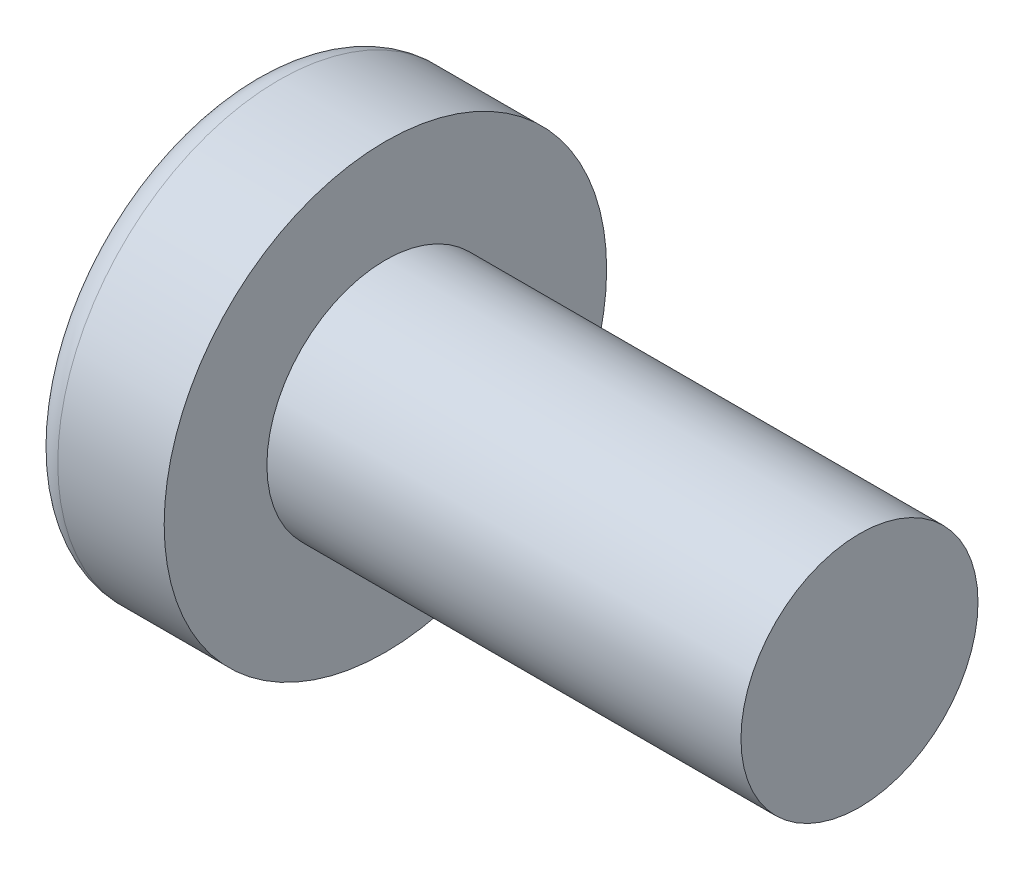
ISO-10303-21;
HEADER;
FILE_DESCRIPTION(('STEP AP214'),'2;1');
FILE_NAME('part.step','',(''),(''),'','','');
FILE_SCHEMA(('AUTOMOTIVE_DESIGN { 1 0 10303 214 1 1 1 1 }'));
ENDSEC;
DATA;
#1=APPLICATION_CONTEXT('core data for automotive mechanical design processes');
#2=APPLICATION_PROTOCOL_DEFINITION('international standard','automotive_design',2000,#1);
#3=PRODUCT_CONTEXT('',#1,'mechanical');
#4=PRODUCT('Part','Part','',(#3));
#5=PRODUCT_RELATED_PRODUCT_CATEGORY('part','',(#4));
#6=PRODUCT_DEFINITION_FORMATION('','',#4);
#7=PRODUCT_DEFINITION_CONTEXT('part definition',#1,'design');
#8=PRODUCT_DEFINITION('design','',#6,#7);
#9=PRODUCT_DEFINITION_SHAPE('','',#8);
#10=(LENGTH_UNIT() NAMED_UNIT(*) SI_UNIT(.MILLI.,.METRE.));
#11=(NAMED_UNIT(*) PLANE_ANGLE_UNIT() SI_UNIT($,.RADIAN.));
#12=(NAMED_UNIT(*) SI_UNIT($,.STERADIAN.) SOLID_ANGLE_UNIT());
#13=UNCERTAINTY_MEASURE_WITH_UNIT(LENGTH_MEASURE(1.E-05),#10,'distance_accuracy_value','');
#14=(GEOMETRIC_REPRESENTATION_CONTEXT(3) GLOBAL_UNCERTAINTY_ASSIGNED_CONTEXT((#13)) GLOBAL_UNIT_ASSIGNED_CONTEXT((#10,
#11,#12)) REPRESENTATION_CONTEXT('',''));
#15=CARTESIAN_POINT('',(0.,0.,0.));
#16=DIRECTION('',(0.,0.,1.));
#17=DIRECTION('',(1.,0.,0.));
#18=AXIS2_PLACEMENT_3D('',#15,#16,#17);
#19=CARTESIAN_POINT('',(5.,0.,0.));
#20=DIRECTION('',(-1.,0.,0.));
#21=DIRECTION('',(0.,1.,0.));
#22=AXIS2_PLACEMENT_3D('',#19,#20,#21);
#23=SPHERICAL_SURFACE('',#22,5.);
#24=CARTESIAN_POINT('',(0.747150706810473,0.,0.));
#25=DIRECTION('',(-1.,0.,0.));
#26=DIRECTION('',(0.,0.,1.));
#27=AXIS2_PLACEMENT_3D('',#24,#25,#26);
#28=CIRCLE('',#27,2.62931034482759);
#29=CARTESIAN_POINT('',(0.747150706810473,0.,2.62931034482759));
#30=VERTEX_POINT('',#29);
#31=EDGE_CURVE('E152',#30,#30,#28,.T.);
#32=ORIENTED_EDGE('',*,*,#31,.T.);
#33=EDGE_LOOP('',(#32));
#34=FACE_BOUND('',#33,.T.);
#35=CARTESIAN_POINT('',(4.98382636322272,-0.153868112043297,0.));
#36=DIRECTION('',(-0.104537710696287,-0.994520923380891,0.));
#37=DIRECTION('',(0.994520923380891,-0.104537710696287,0.));
#38=AXIS2_PLACEMENT_3D('',#35,#36,#37);
#39=CIRCLE('',#38,4.99760572850336);
#40=CARTESIAN_POINT('',(0.188596138461545,0.350175974082163,1.31444652548076));
#41=VERTEX_POINT('',#40);
#42=CARTESIAN_POINT('',(0.0270341343313624,0.367158343834486,0.367158343834487));
#43=VERTEX_POINT('',#42);
#44=EDGE_CURVE('E183',#41,#43,#39,.T.);
#45=ORIENTED_EDGE('',*,*,#44,.F.);
#46=CARTESIAN_POINT('',(3.98403090792016,0.,-1.41352221506761));
#47=DIRECTION('',(0.583636048152575,0.,0.812015371342713));
#48=DIRECTION('',(0.812015371342714,0.,-0.583636048152575));
#49=AXIS2_PLACEMENT_3D('',#46,#47,#48);
#50=CIRCLE('',#49,4.68719124331927);
#51=CARTESIAN_POINT('',(0.188596138461545,-0.350175974082172,1.31444652548076));
#52=VERTEX_POINT('',#51);
#53=EDGE_CURVE('E148',#41,#52,#50,.T.);
#54=ORIENTED_EDGE('',*,*,#53,.T.);
#55=CARTESIAN_POINT('',(4.98382636322272,0.153868112043297,0.));
#56=DIRECTION('',(-0.104537710696287,0.994520923380891,0.));
#57=DIRECTION('',(-0.994520923380891,-0.104537710696287,0.));
#58=AXIS2_PLACEMENT_3D('',#55,#56,#57);
#59=CIRCLE('',#58,4.99760572850336);
#60=CARTESIAN_POINT('',(0.0270341343313616,-0.367158343834489,0.367158343834487));
#61=VERTEX_POINT('',#60);
#62=EDGE_CURVE('E104',#61,#52,#59,.T.);
#63=ORIENTED_EDGE('',*,*,#62,.F.);
#64=CARTESIAN_POINT('',(4.98382636322272,0.,-0.153868112043297));
#65=DIRECTION('',(-0.104537710696287,0.,-0.994520923380891));
#66=DIRECTION('',(-0.994520923380891,0.,0.104537710696287));
#67=AXIS2_PLACEMENT_3D('',#64,#65,#66);
#68=CIRCLE('',#67,4.99760572850336);
#69=CARTESIAN_POINT('',(0.188596138461545,-1.31444652548077,0.350175974082167));
#70=VERTEX_POINT('',#69);
#71=EDGE_CURVE('E129',#70,#61,#68,.T.);
#72=ORIENTED_EDGE('',*,*,#71,.F.);
#73=CARTESIAN_POINT('',(3.98403090792016,1.41352221506761,0.));
#74=DIRECTION('',(0.583636048152575,-0.812015371342713,0.));
#75=DIRECTION('',(0.812015371342714,0.583636048152575,0.));
#76=AXIS2_PLACEMENT_3D('',#73,#74,#75);
#77=CIRCLE('',#76,4.68719124331927);
#78=CARTESIAN_POINT('',(0.188596138461545,-1.31444652548077,-0.350175974082167));
#79=VERTEX_POINT('',#78);
#80=EDGE_CURVE('E137',#70,#79,#77,.T.);
#81=ORIENTED_EDGE('',*,*,#80,.T.);
#82=CARTESIAN_POINT('',(4.98382636322272,0.,0.153868112043297));
#83=DIRECTION('',(-0.104537710696287,0.,0.994520923380891));
#84=DIRECTION('',(0.994520923380891,0.,0.104537710696287));
#85=AXIS2_PLACEMENT_3D('',#82,#83,#84);
#86=CIRCLE('',#85,4.99760572850336);
#87=CARTESIAN_POINT('',(0.0270341343313624,-0.367158343834486,-0.367158343834487));
#88=VERTEX_POINT('',#87);
#89=EDGE_CURVE('E47',#88,#79,#86,.T.);
#90=ORIENTED_EDGE('',*,*,#89,.F.);
#91=CARTESIAN_POINT('',(0.188596138461545,-0.350175974082162,-1.31444652548077));
#92=VERTEX_POINT('',#91);
#93=EDGE_CURVE('E190',#92,#88,#59,.T.);
#94=ORIENTED_EDGE('',*,*,#93,.F.);
#95=CARTESIAN_POINT('',(3.98403090792016,0.,1.41352221506761));
#96=DIRECTION('',(0.583636048152575,0.,-0.812015371342713));
#97=DIRECTION('',(-0.812015371342714,0.,-0.583636048152575));
#98=AXIS2_PLACEMENT_3D('',#95,#96,#97);
#99=CIRCLE('',#98,4.68719124331927);
#100=CARTESIAN_POINT('',(0.188596138461545,0.350175974082172,-1.31444652548076));
#101=VERTEX_POINT('',#100);
#102=EDGE_CURVE('E130',#92,#101,#99,.T.);
#103=ORIENTED_EDGE('',*,*,#102,.T.);
#104=CARTESIAN_POINT('',(0.0270341343313616,0.367158343834489,-0.367158343834487));
#105=VERTEX_POINT('',#104);
#106=EDGE_CURVE('E178',#105,#101,#39,.T.);
#107=ORIENTED_EDGE('',*,*,#106,.F.);
#108=CARTESIAN_POINT('',(0.188596138461545,1.31444652548076,-0.350175974082167));
#109=VERTEX_POINT('',#108);
#110=EDGE_CURVE('E40',#109,#105,#86,.T.);
#111=ORIENTED_EDGE('',*,*,#110,.F.);
#112=CARTESIAN_POINT('',(3.98403090792016,-1.41352221506761,0.));
#113=DIRECTION('',(0.583636048152575,0.812015371342713,0.));
#114=DIRECTION('',(-0.812015371342714,0.583636048152575,0.));
#115=AXIS2_PLACEMENT_3D('',#112,#113,#114);
#116=CIRCLE('',#115,4.68719124331927);
#117=CARTESIAN_POINT('',(0.188596138461545,1.31444652548076,0.350175974082167));
#118=VERTEX_POINT('',#117);
#119=EDGE_CURVE('E11',#109,#118,#116,.T.);
#120=ORIENTED_EDGE('',*,*,#119,.T.);
#121=EDGE_CURVE('E166',#43,#118,#68,.T.);
#122=ORIENTED_EDGE('',*,*,#121,.F.);
#123=EDGE_LOOP('',(#45,#54,#63,#72,#81,#90,#94,#103,#107,#111,#120,#122));
#124=FACE_BOUND('',#123,.T.);
#125=ADVANCED_FACE('F32',(#34,#124),#23,.T.);
#126=CARTESIAN_POINT('',(2.01739130434783,0.,-0.15794466403162));
#127=DIRECTION('',(-0.104537710696287,0.,0.994520923380891));
#128=DIRECTION('',(0.994520923380891,0.,0.104537710696287));
#129=AXIS2_PLACEMENT_3D('',#126,#127,#128);
#130=PLANE('',#129);
#131=ORIENTED_EDGE('',*,*,#110,.T.);
#132=DIRECTION('',(0.989130931836555,-0.103971149085093,0.103971149085092));
#133=VECTOR('',#132,1.);
#134=CARTESIAN_POINT('',(2.03363450411053,0.156237282238383,-0.156237282238382));
#135=LINE('',#134,#133);
#136=CARTESIAN_POINT('',(1.76,0.185000000000001,-0.184999999999999));
#137=VERTEX_POINT('',#136);
#138=EDGE_CURVE('E172',#105,#137,#135,.T.);
#139=ORIENTED_EDGE('',*,*,#138,.T.);
#140=DIRECTION('',(0.80907355338853,-0.581521616498006,0.0850446632823171));
#141=VECTOR('',#140,1.);
#142=CARTESIAN_POINT('',(0.,1.45,-0.37));
#143=LINE('',#142,#141);
#144=EDGE_CURVE('E153',#109,#137,#143,.T.);
#145=ORIENTED_EDGE('',*,*,#144,.F.);
#146=EDGE_LOOP('',(#131,#139,#145));
#147=FACE_BOUND('',#146,.T.);
#148=ADVANCED_FACE('F171',(#147),#130,.T.);
#149=DIRECTION('',(0.80907355338853,0.581521616498006,0.0850446632823171));
#150=VECTOR('',#149,1.);
#151=CARTESIAN_POINT('',(0.,-1.45,-0.37));
#152=LINE('',#151,#150);
#153=CARTESIAN_POINT('',(1.76,-0.185,-0.185));
#154=VERTEX_POINT('',#153);
#155=EDGE_CURVE('E138',#79,#154,#152,.T.);
#156=ORIENTED_EDGE('',*,*,#155,.T.);
#157=DIRECTION('',(-0.989130931836555,-0.103971149085092,-0.103971149085092));
#158=VECTOR('',#157,1.);
#159=CARTESIAN_POINT('',(2.03363450411053,-0.156237282238382,-0.156237282238382));
#160=LINE('',#159,#158);
#161=EDGE_CURVE('E193',#154,#88,#160,.T.);
#162=ORIENTED_EDGE('',*,*,#161,.T.);
#163=ORIENTED_EDGE('',*,*,#89,.T.);
#164=EDGE_LOOP('',(#156,#162,#163));
#165=FACE_BOUND('',#164,.T.);
#166=ADVANCED_FACE('F208',(#165),#130,.T.);
#167=CARTESIAN_POINT('',(2.01739130434783,0.,0.15794466403162));
#168=DIRECTION('',(-0.104537710696287,0.,-0.994520923380891));
#169=DIRECTION('',(-0.994520923380891,0.,0.104537710696287));
#170=AXIS2_PLACEMENT_3D('',#167,#168,#169);
#171=PLANE('',#170);
#172=DIRECTION('',(0.80907355338853,-0.581521616498006,-0.0850446632823171));
#173=VECTOR('',#172,1.);
#174=CARTESIAN_POINT('',(0.,1.45,0.37));
#175=LINE('',#174,#173);
#176=CARTESIAN_POINT('',(1.76,0.185,0.185));
#177=VERTEX_POINT('',#176);
#178=EDGE_CURVE('E209',#118,#177,#175,.T.);
#179=ORIENTED_EDGE('',*,*,#178,.T.);
#180=DIRECTION('',(-0.989130931836555,0.103971149085092,0.103971149085092));
#181=VECTOR('',#180,1.);
#182=CARTESIAN_POINT('',(2.03363450411053,0.156237282238382,0.156237282238382));
#183=LINE('',#182,#181);
#184=EDGE_CURVE('E187',#177,#43,#183,.T.);
#185=ORIENTED_EDGE('',*,*,#184,.T.);
#186=ORIENTED_EDGE('',*,*,#121,.T.);
#187=EDGE_LOOP('',(#179,#185,#186));
#188=FACE_BOUND('',#187,.T.);
#189=ADVANCED_FACE('F213',(#188),#171,.T.);
#190=ORIENTED_EDGE('',*,*,#71,.T.);
#191=DIRECTION('',(0.989130931836555,0.103971149085093,-0.103971149085092));
#192=VECTOR('',#191,1.);
#193=CARTESIAN_POINT('',(2.03363450411053,-0.156237282238383,0.156237282238382));
#194=LINE('',#193,#192);
#195=CARTESIAN_POINT('',(1.76,-0.185000000000001,0.184999999999999));
#196=VERTEX_POINT('',#195);
#197=EDGE_CURVE('E102',#61,#196,#194,.T.);
#198=ORIENTED_EDGE('',*,*,#197,.T.);
#199=DIRECTION('',(0.80907355338853,0.581521616498006,-0.085044663282317));
#200=VECTOR('',#199,1.);
#201=CARTESIAN_POINT('',(0.,-1.45,0.37));
#202=LINE('',#201,#200);
#203=EDGE_CURVE('E127',#70,#196,#202,.T.);
#204=ORIENTED_EDGE('',*,*,#203,.F.);
#205=EDGE_LOOP('',(#190,#198,#204));
#206=FACE_BOUND('',#205,.T.);
#207=ADVANCED_FACE('F126',(#206),#171,.T.);
#208=CARTESIAN_POINT('',(-25.4,0.,0.));
#209=DIRECTION('',(-1.,0.,0.));
#210=DIRECTION('',(0.,0.,1.));
#211=AXIS2_PLACEMENT_3D('',#208,#209,#210);
#212=CYLINDRICAL_SURFACE('',#211,1.5);
#213=CARTESIAN_POINT('',(8.4,0.,0.));
#214=DIRECTION('',(-1.,0.,0.));
#215=DIRECTION('',(0.,0.,1.));
#216=AXIS2_PLACEMENT_3D('',#213,#214,#215);
#217=CIRCLE('',#216,1.5);
#218=CARTESIAN_POINT('',(8.4,0.,1.5));
#219=VERTEX_POINT('',#218);
#220=EDGE_CURVE('E149',#219,#219,#217,.T.);
#221=ORIENTED_EDGE('',*,*,#220,.T.);
#222=EDGE_LOOP('',(#221));
#223=FACE_BOUND('',#222,.T.);
#224=CARTESIAN_POINT('',(2.4,0.,0.));
#225=DIRECTION('',(-1.,0.,0.));
#226=DIRECTION('',(0.,0.,1.));
#227=AXIS2_PLACEMENT_3D('',#224,#225,#226);
#228=CIRCLE('',#227,1.5);
#229=CARTESIAN_POINT('',(2.4,0.,1.5));
#230=VERTEX_POINT('',#229);
#231=EDGE_CURVE('E162',#230,#230,#228,.T.);
#232=ORIENTED_EDGE('',*,*,#231,.F.);
#233=EDGE_LOOP('',(#232));
#234=FACE_BOUND('',#233,.T.);
#235=ADVANCED_FACE('F34',(#223,#234),#212,.T.);
#236=CARTESIAN_POINT('',(2.4,1.5,0.));
#237=DIRECTION('',(-1.,0.,0.));
#238=DIRECTION('',(0.,0.,1.));
#239=AXIS2_PLACEMENT_3D('',#236,#237,#238);
#240=PLANE('',#239);
#241=CARTESIAN_POINT('',(2.4,0.,0.));
#242=DIRECTION('',(-1.,0.,0.));
#243=DIRECTION('',(0.,0.,1.));
#244=AXIS2_PLACEMENT_3D('',#241,#242,#243);
#245=CIRCLE('',#244,2.8);
#246=CARTESIAN_POINT('',(2.4,0.,2.8));
#247=VERTEX_POINT('',#246);
#248=EDGE_CURVE('E159',#247,#247,#245,.T.);
#249=ORIENTED_EDGE('',*,*,#248,.F.);
#250=EDGE_LOOP('',(#249));
#251=FACE_BOUND('',#250,.T.);
#252=ORIENTED_EDGE('',*,*,#231,.T.);
#253=EDGE_LOOP('',(#252));
#254=FACE_BOUND('',#253,.T.);
#255=ADVANCED_FACE('F241',(#251,#254),#240,.F.);
#256=CARTESIAN_POINT('',(-25.4,0.,0.));
#257=DIRECTION('',(-1.,0.,0.));
#258=DIRECTION('',(0.,0.,1.));
#259=AXIS2_PLACEMENT_3D('',#256,#257,#258);
#260=CYLINDRICAL_SURFACE('',#259,2.8);
#261=ORIENTED_EDGE('',*,*,#248,.T.);
#262=EDGE_LOOP('',(#261));
#263=FACE_BOUND('',#262,.T.);
#264=CARTESIAN_POINT('',(1.05335585592012,0.,0.));
#265=DIRECTION('',(-1.,0.,0.));
#266=DIRECTION('',(0.,0.,1.));
#267=AXIS2_PLACEMENT_3D('',#264,#265,#266);
#268=CIRCLE('',#267,2.8);
#269=CARTESIAN_POINT('',(1.05335585592012,0.,2.8));
#270=VERTEX_POINT('',#269);
#271=EDGE_CURVE('E156',#270,#270,#268,.T.);
#272=ORIENTED_EDGE('',*,*,#271,.F.);
#273=EDGE_LOOP('',(#272));
#274=FACE_BOUND('',#273,.T.);
#275=ADVANCED_FACE('F238',(#263,#274),#260,.T.);
#276=CARTESIAN_POINT('',(1.05335585592012,0.,0.));
#277=DIRECTION('',(-1.,0.,0.));
#278=DIRECTION('',(0.,0.,1.));
#279=AXIS2_PLACEMENT_3D('',#276,#277,#278);
#280=TOROIDAL_SURFACE('',#279,2.44,0.360000000000001);
#281=ORIENTED_EDGE('',*,*,#271,.T.);
#282=EDGE_LOOP('',(#281));
#283=FACE_BOUND('',#282,.T.);
#284=ORIENTED_EDGE('',*,*,#31,.F.);
#285=EDGE_LOOP('',(#284));
#286=FACE_BOUND('',#285,.T.);
#287=ADVANCED_FACE('F235',(#283,#286),#280,.T.);
#288=CARTESIAN_POINT('',(8.4,1.5,0.));
#289=DIRECTION('',(1.,0.,0.));
#290=DIRECTION('',(0.,0.,-1.));
#291=AXIS2_PLACEMENT_3D('',#288,#289,#290);
#292=PLANE('',#291);
#293=ORIENTED_EDGE('',*,*,#220,.F.);
#294=EDGE_LOOP('',(#293));
#295=FACE_BOUND('',#294,.T.);
#296=ADVANCED_FACE('F233',(#295),#292,.T.);
#297=CARTESIAN_POINT('',(1.76,0.185,0.185));
#298=DIRECTION('',(0.583636048152575,0.812015371342713,0.));
#299=DIRECTION('',(-0.812015371342714,0.583636048152575,0.));
#300=AXIS2_PLACEMENT_3D('',#297,#298,#299);
#301=PLANE('',#300);
#302=ORIENTED_EDGE('',*,*,#144,.T.);
#303=DIRECTION('',(0.,0.,-1.));
#304=VECTOR('',#303,1.);
#305=CARTESIAN_POINT('',(1.76,0.185,0.185));
#306=LINE('',#305,#304);
#307=EDGE_CURVE('E120',#177,#137,#306,.T.);
#308=ORIENTED_EDGE('',*,*,#307,.F.);
#309=ORIENTED_EDGE('',*,*,#178,.F.);
#310=ORIENTED_EDGE('',*,*,#119,.F.);
#311=EDGE_LOOP('',(#302,#308,#309,#310));
#312=FACE_BOUND('',#311,.T.);
#313=ADVANCED_FACE('F212',(#312),#301,.F.);
#314=CARTESIAN_POINT('',(1.76,-0.185,-0.185));
#315=DIRECTION('',(0.583636048152575,-0.812015371342713,0.));
#316=DIRECTION('',(0.812015371342714,0.583636048152575,0.));
#317=AXIS2_PLACEMENT_3D('',#314,#315,#316);
#318=PLANE('',#317);
#319=ORIENTED_EDGE('',*,*,#203,.T.);
#320=DIRECTION('',(0.,0.,1.));
#321=VECTOR('',#320,1.);
#322=CARTESIAN_POINT('',(1.76,-0.185,-0.185));
#323=LINE('',#322,#321);
#324=EDGE_CURVE('E119',#154,#196,#323,.T.);
#325=ORIENTED_EDGE('',*,*,#324,.F.);
#326=ORIENTED_EDGE('',*,*,#155,.F.);
#327=ORIENTED_EDGE('',*,*,#80,.F.);
#328=EDGE_LOOP('',(#319,#325,#326,#327));
#329=FACE_BOUND('',#328,.T.);
#330=ADVANCED_FACE('F134',(#329),#318,.F.);
#331=CARTESIAN_POINT('',(1.76,0.185,-0.185));
#332=DIRECTION('',(-1.,0.,0.));
#333=DIRECTION('',(0.,0.,1.));
#334=AXIS2_PLACEMENT_3D('',#331,#332,#333);
#335=PLANE('',#334);
#336=DIRECTION('',(0.,1.,0.));
#337=VECTOR('',#336,1.);
#338=CARTESIAN_POINT('',(1.76,-0.185,-0.185));
#339=LINE('',#338,#337);
#340=EDGE_CURVE('E142',#154,#137,#339,.T.);
#341=ORIENTED_EDGE('',*,*,#340,.F.);
#342=ORIENTED_EDGE('',*,*,#324,.T.);
#343=DIRECTION('',(0.,-1.,0.));
#344=VECTOR('',#343,1.);
#345=CARTESIAN_POINT('',(1.76,0.185,0.185));
#346=LINE('',#345,#344);
#347=EDGE_CURVE('E111',#177,#196,#346,.T.);
#348=ORIENTED_EDGE('',*,*,#347,.F.);
#349=ORIENTED_EDGE('',*,*,#307,.T.);
#350=EDGE_LOOP('',(#341,#342,#348,#349));
#351=FACE_BOUND('',#350,.T.);
#352=ADVANCED_FACE('F140',(#351),#335,.T.);
#353=CARTESIAN_POINT('',(1.76,0.185000000000001,-0.184999999999999));
#354=DIRECTION('',(0.583636048152575,0.,-0.812015371342713));
#355=DIRECTION('',(0.812015371342714,0.,0.583636048152575));
#356=AXIS2_PLACEMENT_3D('',#353,#354,#355);
#357=PLANE('',#356);
#358=DIRECTION('',(0.80907355338853,0.085044663282315,0.581521616498006));
#359=VECTOR('',#358,1.);
#360=CARTESIAN_POINT('',(0.,-0.369999999999995,-1.45));
#361=LINE('',#360,#359);
#362=EDGE_CURVE('E198',#92,#154,#361,.T.);
#363=ORIENTED_EDGE('',*,*,#362,.T.);
#364=ORIENTED_EDGE('',*,*,#340,.T.);
#365=DIRECTION('',(0.80907355338853,-0.0850446632823191,0.581521616498006));
#366=VECTOR('',#365,1.);
#367=CARTESIAN_POINT('',(0.,0.370000000000005,-1.45));
#368=LINE('',#367,#366);
#369=EDGE_CURVE('E108',#101,#137,#368,.T.);
#370=ORIENTED_EDGE('',*,*,#369,.F.);
#371=ORIENTED_EDGE('',*,*,#102,.F.);
#372=EDGE_LOOP('',(#363,#364,#370,#371));
#373=FACE_BOUND('',#372,.T.);
#374=ADVANCED_FACE('F203',(#373),#357,.F.);
#375=CARTESIAN_POINT('',(2.01739130434783,-0.15794466403162,0.));
#376=DIRECTION('',(-0.104537710696287,0.994520923380891,0.));
#377=DIRECTION('',(-0.994520923380891,-0.104537710696287,0.));
#378=AXIS2_PLACEMENT_3D('',#375,#376,#377);
#379=PLANE('',#378);
#380=ORIENTED_EDGE('',*,*,#93,.T.);
#381=ORIENTED_EDGE('',*,*,#161,.F.);
#382=ORIENTED_EDGE('',*,*,#362,.F.);
#383=EDGE_LOOP('',(#380,#381,#382));
#384=FACE_BOUND('',#383,.T.);
#385=ADVANCED_FACE('F207',(#384),#379,.T.);
#386=CARTESIAN_POINT('',(2.01739130434783,0.15794466403162,0.));
#387=DIRECTION('',(-0.104537710696287,-0.994520923380891,0.));
#388=DIRECTION('',(0.994520923380891,-0.104537710696287,0.));
#389=AXIS2_PLACEMENT_3D('',#386,#387,#388);
#390=PLANE('',#389);
#391=ORIENTED_EDGE('',*,*,#106,.T.);
#392=ORIENTED_EDGE('',*,*,#369,.T.);
#393=ORIENTED_EDGE('',*,*,#138,.F.);
#394=EDGE_LOOP('',(#391,#392,#393));
#395=FACE_BOUND('',#394,.T.);
#396=ADVANCED_FACE('F201',(#395),#390,.T.);
#397=CARTESIAN_POINT('',(1.76,-0.185000000000001,0.184999999999999));
#398=DIRECTION('',(0.583636048152575,0.,0.812015371342713));
#399=DIRECTION('',(-0.812015371342714,0.,0.583636048152575));
#400=AXIS2_PLACEMENT_3D('',#397,#398,#399);
#401=PLANE('',#400);
#402=DIRECTION('',(0.80907355338853,-0.0850446632823151,-0.581521616498006));
#403=VECTOR('',#402,1.);
#404=CARTESIAN_POINT('',(0.,0.369999999999995,1.45));
#405=LINE('',#404,#403);
#406=EDGE_CURVE('E107',#41,#177,#405,.T.);
#407=ORIENTED_EDGE('',*,*,#406,.T.);
#408=ORIENTED_EDGE('',*,*,#347,.T.);
#409=DIRECTION('',(0.80907355338853,0.0850446632823192,-0.581521616498006));
#410=VECTOR('',#409,1.);
#411=CARTESIAN_POINT('',(0.,-0.370000000000005,1.45));
#412=LINE('',#411,#410);
#413=EDGE_CURVE('E98',#52,#196,#412,.T.);
#414=ORIENTED_EDGE('',*,*,#413,.F.);
#415=ORIENTED_EDGE('',*,*,#53,.F.);
#416=EDGE_LOOP('',(#407,#408,#414,#415));
#417=FACE_BOUND('',#416,.T.);
#418=ADVANCED_FACE('F112',(#417),#401,.F.);
#419=ORIENTED_EDGE('',*,*,#44,.T.);
#420=ORIENTED_EDGE('',*,*,#184,.F.);
#421=ORIENTED_EDGE('',*,*,#406,.F.);
#422=EDGE_LOOP('',(#419,#420,#421));
#423=FACE_BOUND('',#422,.T.);
#424=ADVANCED_FACE('F214',(#423),#390,.T.);
#425=ORIENTED_EDGE('',*,*,#62,.T.);
#426=ORIENTED_EDGE('',*,*,#413,.T.);
#427=ORIENTED_EDGE('',*,*,#197,.F.);
#428=EDGE_LOOP('',(#425,#426,#427));
#429=FACE_BOUND('',#428,.T.);
#430=ADVANCED_FACE('F100',(#429),#379,.T.);
#431=CLOSED_SHELL('',(#125,#148,#166,#189,#207,#235,#255,#275,#287,#296,#313,#330,#352,#374,
#385,#396,#418,#424,#430));
#432=MANIFOLD_SOLID_BREP('B2',#431);
#433=ADVANCED_BREP_SHAPE_REPRESENTATION('',(#18,#432),#14);
#434=SHAPE_DEFINITION_REPRESENTATION(#9,#433);
ENDSEC;
END-ISO-10303-21;
